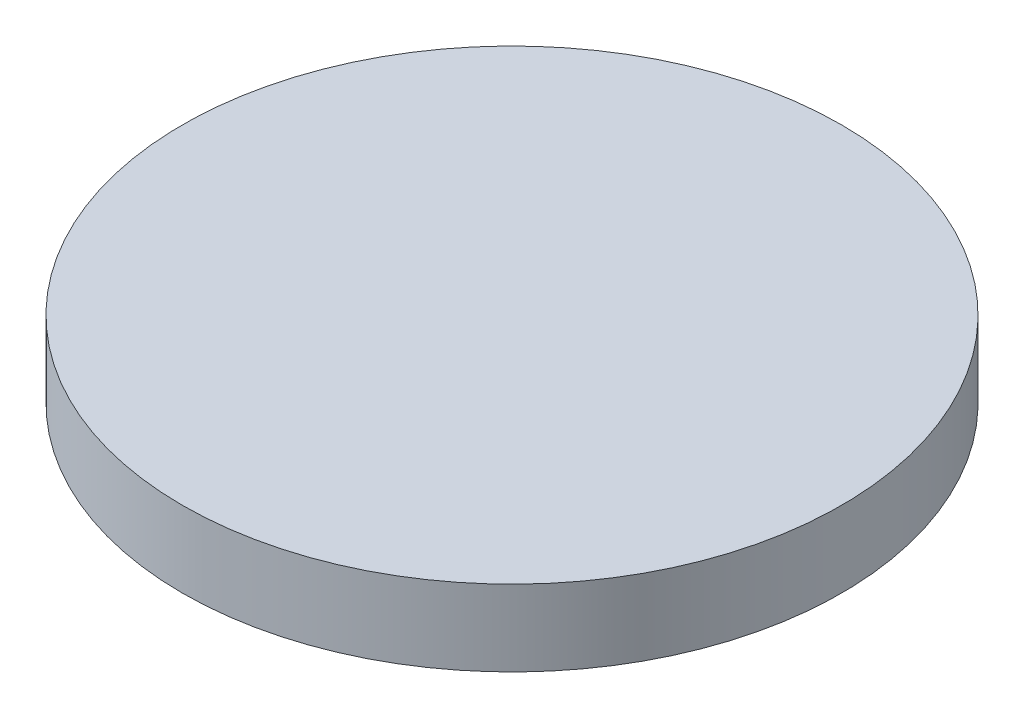
ISO-10303-21;
HEADER;
FILE_DESCRIPTION(('STEP AP214'),'2;1');
FILE_NAME('part.step','',(''),(''),'','','');
FILE_SCHEMA(('AUTOMOTIVE_DESIGN { 1 0 10303 214 1 1 1 1 }'));
ENDSEC;
DATA;
#1=APPLICATION_CONTEXT('core data for automotive mechanical design processes');
#2=APPLICATION_PROTOCOL_DEFINITION('international standard','automotive_design',2000,#1);
#3=PRODUCT_CONTEXT('',#1,'mechanical');
#4=PRODUCT('Part','Part','',(#3));
#5=PRODUCT_RELATED_PRODUCT_CATEGORY('part','',(#4));
#6=PRODUCT_DEFINITION_FORMATION('','',#4);
#7=PRODUCT_DEFINITION_CONTEXT('part definition',#1,'design');
#8=PRODUCT_DEFINITION('design','',#6,#7);
#9=PRODUCT_DEFINITION_SHAPE('','',#8);
#10=(LENGTH_UNIT() NAMED_UNIT(*) SI_UNIT(.MILLI.,.METRE.));
#11=(NAMED_UNIT(*) PLANE_ANGLE_UNIT() SI_UNIT($,.RADIAN.));
#12=(NAMED_UNIT(*) SI_UNIT($,.STERADIAN.) SOLID_ANGLE_UNIT());
#13=UNCERTAINTY_MEASURE_WITH_UNIT(LENGTH_MEASURE(1.E-05),#10,'distance_accuracy_value','');
#14=(GEOMETRIC_REPRESENTATION_CONTEXT(3) GLOBAL_UNCERTAINTY_ASSIGNED_CONTEXT((#13)) GLOBAL_UNIT_ASSIGNED_CONTEXT((#10,
#11,#12)) REPRESENTATION_CONTEXT('',''));
#15=CARTESIAN_POINT('',(0.,0.,0.));
#16=DIRECTION('',(0.,0.,1.));
#17=DIRECTION('',(1.,0.,0.));
#18=AXIS2_PLACEMENT_3D('',#15,#16,#17);
#19=CARTESIAN_POINT('',(0.,5.,0.));
#20=DIRECTION('',(0.,-1.,0.));
#21=DIRECTION('',(0.,0.,-1.));
#22=AXIS2_PLACEMENT_3D('',#19,#20,#21);
#23=CYLINDRICAL_SURFACE('',#22,30.);
#24=CARTESIAN_POINT('',(0.,5.,0.));
#25=DIRECTION('',(0.,1.,0.));
#26=DIRECTION('',(0.,0.,1.));
#27=AXIS2_PLACEMENT_3D('',#24,#25,#26);
#28=CIRCLE('',#27,30.);
#29=CARTESIAN_POINT('',(0.,5.,30.));
#30=VERTEX_POINT('',#29);
#31=EDGE_CURVE('E10',#30,#30,#28,.T.);
#32=ORIENTED_EDGE('',*,*,#31,.F.);
#33=EDGE_LOOP('',(#32));
#34=FACE_BOUND('',#33,.T.);
#35=CARTESIAN_POINT('',(0.,0.,0.));
#36=DIRECTION('',(0.,1.,0.));
#37=DIRECTION('',(0.,0.,1.));
#38=AXIS2_PLACEMENT_3D('',#35,#36,#37);
#39=CIRCLE('',#38,30.);
#40=CARTESIAN_POINT('',(0.,0.,30.));
#41=VERTEX_POINT('',#40);
#42=EDGE_CURVE('E40',#41,#41,#39,.T.);
#43=ORIENTED_EDGE('',*,*,#42,.T.);
#44=EDGE_LOOP('',(#43));
#45=FACE_BOUND('',#44,.T.);
#46=ADVANCED_FACE('F37',(#34,#45),#23,.T.);
#47=CARTESIAN_POINT('',(0.,0.,0.));
#48=DIRECTION('',(0.,1.,0.));
#49=DIRECTION('',(0.,0.,1.));
#50=AXIS2_PLACEMENT_3D('',#47,#48,#49);
#51=PLANE('',#50);
#52=ORIENTED_EDGE('',*,*,#42,.F.);
#53=EDGE_LOOP('',(#52));
#54=FACE_BOUND('',#53,.T.);
#55=ADVANCED_FACE('F64',(#54),#51,.F.);
#56=CARTESIAN_POINT('',(0.,14.,0.));
#57=DIRECTION('',(0.,-1.,0.));
#58=DIRECTION('',(0.,0.,-1.));
#59=AXIS2_PLACEMENT_3D('',#56,#57,#58);
#60=CYLINDRICAL_SURFACE('',#59,39.);
#61=CARTESIAN_POINT('',(0.,14.,0.));
#62=DIRECTION('',(0.,1.,0.));
#63=DIRECTION('',(0.,0.,1.));
#64=AXIS2_PLACEMENT_3D('',#61,#62,#63);
#65=CIRCLE('',#64,39.);
#66=CARTESIAN_POINT('',(0.,14.,39.));
#67=VERTEX_POINT('',#66);
#68=EDGE_CURVE('E49',#67,#67,#65,.T.);
#69=ORIENTED_EDGE('',*,*,#68,.F.);
#70=EDGE_LOOP('',(#69));
#71=FACE_BOUND('',#70,.T.);
#72=CARTESIAN_POINT('',(0.,5.,0.));
#73=DIRECTION('',(0.,1.,0.));
#74=DIRECTION('',(0.,0.,1.));
#75=AXIS2_PLACEMENT_3D('',#72,#73,#74);
#76=CIRCLE('',#75,39.);
#77=CARTESIAN_POINT('',(0.,5.,39.));
#78=VERTEX_POINT('',#77);
#79=EDGE_CURVE('E51',#78,#78,#76,.T.);
#80=ORIENTED_EDGE('',*,*,#79,.T.);
#81=EDGE_LOOP('',(#80));
#82=FACE_BOUND('',#81,.T.);
#83=ADVANCED_FACE('F61',(#71,#82),#60,.T.);
#84=CARTESIAN_POINT('',(0.,14.,0.));
#85=DIRECTION('',(0.,1.,0.));
#86=DIRECTION('',(0.,0.,1.));
#87=AXIS2_PLACEMENT_3D('',#84,#85,#86);
#88=PLANE('',#87);
#89=ORIENTED_EDGE('',*,*,#68,.T.);
#90=EDGE_LOOP('',(#89));
#91=FACE_BOUND('',#90,.T.);
#92=ADVANCED_FACE('F59',(#91),#88,.T.);
#93=CARTESIAN_POINT('',(0.,5.,0.));
#94=DIRECTION('',(0.,1.,0.));
#95=DIRECTION('',(0.,0.,1.));
#96=AXIS2_PLACEMENT_3D('',#93,#94,#95);
#97=PLANE('',#96);
#98=ORIENTED_EDGE('',*,*,#31,.T.);
#99=EDGE_LOOP('',(#98));
#100=FACE_BOUND('',#99,.T.);
#101=ORIENTED_EDGE('',*,*,#79,.F.);
#102=EDGE_LOOP('',(#101));
#103=FACE_BOUND('',#102,.T.);
#104=ADVANCED_FACE('F68',(#100,#103),#97,.F.);
#105=CLOSED_SHELL('',(#46,#55,#83,#92,#104));
#106=MANIFOLD_SOLID_BREP('B2',#105);
#107=ADVANCED_BREP_SHAPE_REPRESENTATION('',(#18,#106),#14);
#108=SHAPE_DEFINITION_REPRESENTATION(#9,#107);
ENDSEC;
END-ISO-10303-21;
